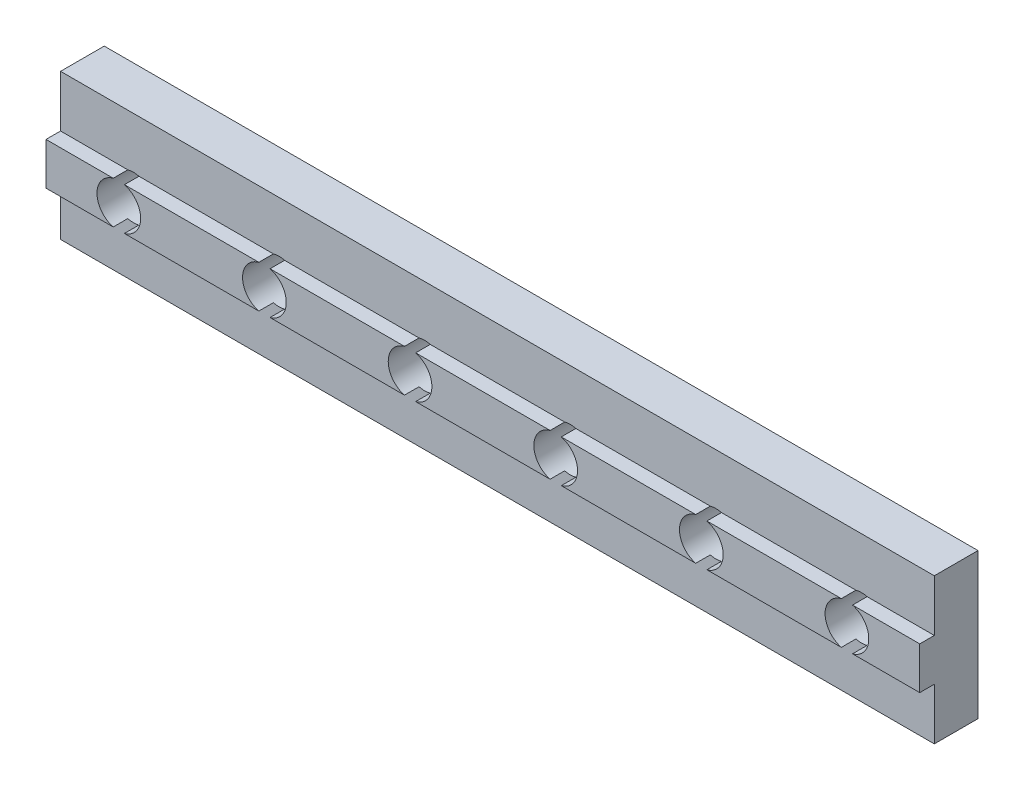
ISO-10303-21;
HEADER;
FILE_DESCRIPTION(('STEP AP214'),'2;1');
FILE_NAME('part.step','',(''),(''),'','','');
FILE_SCHEMA(('AUTOMOTIVE_DESIGN { 1 0 10303 214 1 1 1 1 }'));
ENDSEC;
DATA;
#1=APPLICATION_CONTEXT('core data for automotive mechanical design processes');
#2=APPLICATION_PROTOCOL_DEFINITION('international standard','automotive_design',2000,#1);
#3=PRODUCT_CONTEXT('',#1,'mechanical');
#4=PRODUCT('Part','Part','',(#3));
#5=PRODUCT_RELATED_PRODUCT_CATEGORY('part','',(#4));
#6=PRODUCT_DEFINITION_FORMATION('','',#4);
#7=PRODUCT_DEFINITION_CONTEXT('part definition',#1,'design');
#8=PRODUCT_DEFINITION('design','',#6,#7);
#9=PRODUCT_DEFINITION_SHAPE('','',#8);
#10=(LENGTH_UNIT() NAMED_UNIT(*) SI_UNIT(.MILLI.,.METRE.));
#11=(NAMED_UNIT(*) PLANE_ANGLE_UNIT() SI_UNIT($,.RADIAN.));
#12=(NAMED_UNIT(*) SI_UNIT($,.STERADIAN.) SOLID_ANGLE_UNIT());
#13=UNCERTAINTY_MEASURE_WITH_UNIT(LENGTH_MEASURE(1.E-05),#10,'distance_accuracy_value','');
#14=(GEOMETRIC_REPRESENTATION_CONTEXT(3) GLOBAL_UNCERTAINTY_ASSIGNED_CONTEXT((#13)) GLOBAL_UNIT_ASSIGNED_CONTEXT((#10,
#11,#12)) REPRESENTATION_CONTEXT('',''));
#15=CARTESIAN_POINT('',(0.,0.,0.));
#16=DIRECTION('',(0.,0.,1.));
#17=DIRECTION('',(1.,0.,0.));
#18=AXIS2_PLACEMENT_3D('',#15,#16,#17);
#19=CARTESIAN_POINT('',(60.,6.45000000000001,4.));
#20=DIRECTION('',(0.,-1.,0.));
#21=DIRECTION('',(1.,0.,0.));
#22=AXIS2_PLACEMENT_3D('',#19,#20,#21);
#23=PLANE('',#22);
#24=DIRECTION('',(-1.,0.,0.));
#25=VECTOR('',#24,1.);
#26=CARTESIAN_POINT('',(60.,6.45000000000001,4.));
#27=LINE('',#26,#25);
#28=CARTESIAN_POINT('',(34.6159427126066,6.45000000000001,4.));
#29=VERTEX_POINT('',#28);
#30=CARTESIAN_POINT('',(25.3840572873934,6.45000000000001,4.));
#31=VERTEX_POINT('',#30);
#32=EDGE_CURVE('E291',#29,#31,#27,.T.);
#33=ORIENTED_EDGE('',*,*,#32,.F.);
#34=DIRECTION('',(0.,0.,-1.));
#35=VECTOR('',#34,1.);
#36=CARTESIAN_POINT('',(34.6159427126066,6.45000000000001,4.));
#37=LINE('',#36,#35);
#38=CARTESIAN_POINT('',(34.6159427126066,6.45000000000001,3.));
#39=VERTEX_POINT('',#38);
#40=EDGE_CURVE('E346',#29,#39,#37,.T.);
#41=ORIENTED_EDGE('',*,*,#40,.T.);
#42=DIRECTION('',(-1.,0.,0.));
#43=VECTOR('',#42,1.);
#44=CARTESIAN_POINT('',(60.,6.45000000000001,3.));
#45=LINE('',#44,#43);
#46=CARTESIAN_POINT('',(25.3840572873934,6.45000000000001,3.));
#47=VERTEX_POINT('',#46);
#48=EDGE_CURVE('E406',#39,#47,#45,.T.);
#49=ORIENTED_EDGE('',*,*,#48,.T.);
#50=DIRECTION('',(0.,0.,-1.));
#51=VECTOR('',#50,1.);
#52=CARTESIAN_POINT('',(25.3840572873934,6.45000000000001,4.));
#53=LINE('',#52,#51);
#54=EDGE_CURVE('E333',#47,#31,#53,.F.);
#55=ORIENTED_EDGE('',*,*,#54,.T.);
#56=EDGE_LOOP('',(#33,#41,#49,#55));
#57=FACE_BOUND('',#56,.T.);
#58=ADVANCED_FACE('F33',(#57),#23,.F.);
#59=CARTESIAN_POINT('',(24.6159427126066,6.45000000000001,4.));
#60=VERTEX_POINT('',#59);
#61=CARTESIAN_POINT('',(15.3840572873934,6.45,4.));
#62=VERTEX_POINT('',#61);
#63=EDGE_CURVE('E273',#60,#62,#27,.T.);
#64=ORIENTED_EDGE('',*,*,#63,.F.);
#65=DIRECTION('',(0.,0.,-1.));
#66=VECTOR('',#65,1.);
#67=CARTESIAN_POINT('',(24.6159427126066,6.45000000000001,4.));
#68=LINE('',#67,#66);
#69=CARTESIAN_POINT('',(24.6159427126066,6.45000000000001,3.));
#70=VERTEX_POINT('',#69);
#71=EDGE_CURVE('E313',#60,#70,#68,.T.);
#72=ORIENTED_EDGE('',*,*,#71,.T.);
#73=CARTESIAN_POINT('',(15.3840572873934,6.45,3.));
#74=VERTEX_POINT('',#73);
#75=EDGE_CURVE('E316',#70,#74,#45,.T.);
#76=ORIENTED_EDGE('',*,*,#75,.T.);
#77=DIRECTION('',(0.,0.,-1.));
#78=VECTOR('',#77,1.);
#79=CARTESIAN_POINT('',(15.3840572873934,6.45,4.));
#80=LINE('',#79,#78);
#81=EDGE_CURVE('E315',#74,#62,#80,.F.);
#82=ORIENTED_EDGE('',*,*,#81,.T.);
#83=EDGE_LOOP('',(#64,#72,#76,#82));
#84=FACE_BOUND('',#83,.T.);
#85=ADVANCED_FACE('F311',(#84),#23,.F.);
#86=CARTESIAN_POINT('',(14.6159427126066,6.45,4.));
#87=VERTEX_POINT('',#86);
#88=CARTESIAN_POINT('',(5.38405728739344,6.45,4.));
#89=VERTEX_POINT('',#88);
#90=EDGE_CURVE('E268',#87,#89,#27,.T.);
#91=ORIENTED_EDGE('',*,*,#90,.F.);
#92=DIRECTION('',(0.,0.,-1.));
#93=VECTOR('',#92,1.);
#94=CARTESIAN_POINT('',(14.6159427126066,6.45,4.));
#95=LINE('',#94,#93);
#96=CARTESIAN_POINT('',(14.6159427126066,6.45,3.));
#97=VERTEX_POINT('',#96);
#98=EDGE_CURVE('E319',#87,#97,#95,.T.);
#99=ORIENTED_EDGE('',*,*,#98,.T.);
#100=CARTESIAN_POINT('',(5.38405728739344,6.45,3.));
#101=VERTEX_POINT('',#100);
#102=EDGE_CURVE('E391',#97,#101,#45,.T.);
#103=ORIENTED_EDGE('',*,*,#102,.T.);
#104=DIRECTION('',(0.,0.,-1.));
#105=VECTOR('',#104,1.);
#106=CARTESIAN_POINT('',(5.38405728739344,6.45,4.));
#107=LINE('',#106,#105);
#108=EDGE_CURVE('E252',#101,#89,#107,.F.);
#109=ORIENTED_EDGE('',*,*,#108,.T.);
#110=EDGE_LOOP('',(#91,#99,#103,#109));
#111=FACE_BOUND('',#110,.T.);
#112=ADVANCED_FACE('F575',(#111),#23,.F.);
#113=CARTESIAN_POINT('',(4.61594271260656,6.45,4.));
#114=VERTEX_POINT('',#113);
#115=CARTESIAN_POINT('',(0.,6.45,4.));
#116=VERTEX_POINT('',#115);
#117=EDGE_CURVE('E257',#114,#116,#27,.T.);
#118=ORIENTED_EDGE('',*,*,#117,.F.);
#119=DIRECTION('',(0.,0.,-1.));
#120=VECTOR('',#119,1.);
#121=CARTESIAN_POINT('',(4.61594271260655,6.45,4.));
#122=LINE('',#121,#120);
#123=CARTESIAN_POINT('',(4.61594271260656,6.45,3.));
#124=VERTEX_POINT('',#123);
#125=EDGE_CURVE('E241',#114,#124,#122,.T.);
#126=ORIENTED_EDGE('',*,*,#125,.T.);
#127=CARTESIAN_POINT('',(0.,6.45,3.));
#128=VERTEX_POINT('',#127);
#129=EDGE_CURVE('E387',#124,#128,#45,.T.);
#130=ORIENTED_EDGE('',*,*,#129,.T.);
#131=DIRECTION('',(0.,0.,-1.));
#132=VECTOR('',#131,1.);
#133=CARTESIAN_POINT('',(0.,6.45,4.));
#134=LINE('',#133,#132);
#135=EDGE_CURVE('E266',#116,#128,#134,.T.);
#136=ORIENTED_EDGE('',*,*,#135,.F.);
#137=EDGE_LOOP('',(#118,#126,#130,#136));
#138=FACE_BOUND('',#137,.T.);
#139=ADVANCED_FACE('F264',(#138),#23,.F.);
#140=CARTESIAN_POINT('',(0.,0.,4.));
#141=DIRECTION('',(0.,0.,1.));
#142=DIRECTION('',(1.,0.,0.));
#143=AXIS2_PLACEMENT_3D('',#140,#141,#142);
#144=PLANE('',#143);
#145=CARTESIAN_POINT('',(35.,5.,4.));
#146=DIRECTION('',(0.,0.,-1.));
#147=DIRECTION('',(-1.,0.,0.));
#148=AXIS2_PLACEMENT_3D('',#145,#146,#147);
#149=CIRCLE('',#148,1.5);
#150=CARTESIAN_POINT('',(34.6159427126065,3.55,4.));
#151=VERTEX_POINT('',#150);
#152=EDGE_CURVE('E48',#151,#29,#149,.T.);
#153=ORIENTED_EDGE('',*,*,#152,.T.);
#154=ORIENTED_EDGE('',*,*,#32,.T.);
#155=CARTESIAN_POINT('',(25.,5.,4.));
#156=DIRECTION('',(0.,0.,-1.));
#157=DIRECTION('',(-1.,0.,0.));
#158=AXIS2_PLACEMENT_3D('',#155,#156,#157);
#159=CIRCLE('',#158,1.5);
#160=CARTESIAN_POINT('',(25.3840572873935,3.55,4.));
#161=VERTEX_POINT('',#160);
#162=EDGE_CURVE('E415',#31,#161,#159,.T.);
#163=ORIENTED_EDGE('',*,*,#162,.T.);
#164=DIRECTION('',(1.,0.,0.));
#165=VECTOR('',#164,1.);
#166=CARTESIAN_POINT('',(60.,3.55000000000001,4.));
#167=LINE('',#166,#165);
#168=EDGE_CURVE('E483',#161,#151,#167,.T.);
#169=ORIENTED_EDGE('',*,*,#168,.T.);
#170=EDGE_LOOP('',(#153,#154,#163,#169));
#171=FACE_BOUND('',#170,.T.);
#172=ADVANCED_FACE('F606',(#171),#144,.T.);
#173=CARTESIAN_POINT('',(24.6159427126065,3.55,4.));
#174=VERTEX_POINT('',#173);
#175=EDGE_CURVE('E56',#174,#60,#159,.T.);
#176=ORIENTED_EDGE('',*,*,#175,.T.);
#177=ORIENTED_EDGE('',*,*,#63,.T.);
#178=CARTESIAN_POINT('',(15.,5.,4.));
#179=DIRECTION('',(0.,0.,-1.));
#180=DIRECTION('',(-1.,0.,0.));
#181=AXIS2_PLACEMENT_3D('',#178,#179,#180);
#182=CIRCLE('',#181,1.5);
#183=CARTESIAN_POINT('',(15.3840572873935,3.55,4.));
#184=VERTEX_POINT('',#183);
#185=EDGE_CURVE('E306',#62,#184,#182,.T.);
#186=ORIENTED_EDGE('',*,*,#185,.T.);
#187=EDGE_CURVE('E485',#184,#174,#167,.T.);
#188=ORIENTED_EDGE('',*,*,#187,.T.);
#189=EDGE_LOOP('',(#176,#177,#186,#188));
#190=FACE_BOUND('',#189,.T.);
#191=ADVANCED_FACE('F304',(#190),#144,.T.);
#192=CARTESIAN_POINT('',(14.6159427126066,3.55,4.));
#193=VERTEX_POINT('',#192);
#194=EDGE_CURVE('E429',#193,#87,#182,.T.);
#195=ORIENTED_EDGE('',*,*,#194,.T.);
#196=ORIENTED_EDGE('',*,*,#90,.T.);
#197=CARTESIAN_POINT('',(5.,5.,4.));
#198=DIRECTION('',(0.,0.,-1.));
#199=DIRECTION('',(-1.,0.,0.));
#200=AXIS2_PLACEMENT_3D('',#197,#198,#199);
#201=CIRCLE('',#200,1.5);
#202=CARTESIAN_POINT('',(5.38405728739345,3.55,4.));
#203=VERTEX_POINT('',#202);
#204=EDGE_CURVE('E261',#89,#203,#201,.T.);
#205=ORIENTED_EDGE('',*,*,#204,.T.);
#206=EDGE_CURVE('E486',#203,#193,#167,.T.);
#207=ORIENTED_EDGE('',*,*,#206,.T.);
#208=EDGE_LOOP('',(#195,#196,#205,#207));
#209=FACE_BOUND('',#208,.T.);
#210=ADVANCED_FACE('F618',(#209),#144,.T.);
#211=CARTESIAN_POINT('',(4.61594271260655,3.55,4.));
#212=VERTEX_POINT('',#211);
#213=EDGE_CURVE('E244',#212,#114,#201,.T.);
#214=ORIENTED_EDGE('',*,*,#213,.T.);
#215=ORIENTED_EDGE('',*,*,#117,.T.);
#216=DIRECTION('',(0.,-1.,0.));
#217=VECTOR('',#216,1.);
#218=CARTESIAN_POINT('',(0.,3.55,4.));
#219=LINE('',#218,#217);
#220=CARTESIAN_POINT('',(0.,3.55,4.));
#221=VERTEX_POINT('',#220);
#222=EDGE_CURVE('E279',#116,#221,#219,.T.);
#223=ORIENTED_EDGE('',*,*,#222,.T.);
#224=EDGE_CURVE('E260',#221,#212,#167,.T.);
#225=ORIENTED_EDGE('',*,*,#224,.T.);
#226=EDGE_LOOP('',(#214,#215,#223,#225));
#227=FACE_BOUND('',#226,.T.);
#228=ADVANCED_FACE('F256',(#227),#144,.T.);
#229=CARTESIAN_POINT('',(60.,3.55000000000001,4.));
#230=DIRECTION('',(0.,1.,0.));
#231=DIRECTION('',(-1.,0.,0.));
#232=AXIS2_PLACEMENT_3D('',#229,#230,#231);
#233=PLANE('',#232);
#234=CARTESIAN_POINT('',(35.3840572873935,3.55,4.));
#235=VERTEX_POINT('',#234);
#236=CARTESIAN_POINT('',(44.6159427126065,3.55000000000001,4.));
#237=VERTEX_POINT('',#236);
#238=EDGE_CURVE('E480',#235,#237,#167,.T.);
#239=ORIENTED_EDGE('',*,*,#238,.F.);
#240=DIRECTION('',(0.,0.,-1.));
#241=VECTOR('',#240,1.);
#242=CARTESIAN_POINT('',(35.3840572873935,3.55,4.));
#243=LINE('',#242,#241);
#244=CARTESIAN_POINT('',(35.3840572873935,3.55,3.));
#245=VERTEX_POINT('',#244);
#246=EDGE_CURVE('E11',#235,#245,#243,.T.);
#247=ORIENTED_EDGE('',*,*,#246,.T.);
#248=DIRECTION('',(1.,0.,0.));
#249=VECTOR('',#248,1.);
#250=CARTESIAN_POINT('',(60.,3.55000000000001,3.));
#251=LINE('',#250,#249);
#252=CARTESIAN_POINT('',(44.6159427126065,3.55000000000001,3.));
#253=VERTEX_POINT('',#252);
#254=EDGE_CURVE('E463',#245,#253,#251,.T.);
#255=ORIENTED_EDGE('',*,*,#254,.T.);
#256=DIRECTION('',(0.,0.,-1.));
#257=VECTOR('',#256,1.);
#258=CARTESIAN_POINT('',(44.6159427126065,3.55000000000001,4.));
#259=LINE('',#258,#257);
#260=EDGE_CURVE('E481',#253,#237,#259,.F.);
#261=ORIENTED_EDGE('',*,*,#260,.T.);
#262=EDGE_LOOP('',(#239,#247,#255,#261));
#263=FACE_BOUND('',#262,.T.);
#264=ADVANCED_FACE('F479',(#263),#233,.F.);
#265=CARTESIAN_POINT('',(25.3840572873935,3.55,3.));
#266=VERTEX_POINT('',#265);
#267=CARTESIAN_POINT('',(34.6159427126065,3.55,3.));
#268=VERTEX_POINT('',#267);
#269=EDGE_CURVE('E464',#266,#268,#251,.T.);
#270=ORIENTED_EDGE('',*,*,#269,.T.);
#271=DIRECTION('',(0.,0.,-1.));
#272=VECTOR('',#271,1.);
#273=CARTESIAN_POINT('',(34.6159427126065,3.55,4.));
#274=LINE('',#273,#272);
#275=EDGE_CURVE('E41',#268,#151,#274,.F.);
#276=ORIENTED_EDGE('',*,*,#275,.T.);
#277=ORIENTED_EDGE('',*,*,#168,.F.);
#278=DIRECTION('',(0.,0.,-1.));
#279=VECTOR('',#278,1.);
#280=CARTESIAN_POINT('',(25.3840572873935,3.55,4.));
#281=LINE('',#280,#279);
#282=EDGE_CURVE('E417',#161,#266,#281,.T.);
#283=ORIENTED_EDGE('',*,*,#282,.T.);
#284=EDGE_LOOP('',(#270,#276,#277,#283));
#285=FACE_BOUND('',#284,.T.);
#286=ADVANCED_FACE('F476',(#285),#233,.F.);
#287=CARTESIAN_POINT('',(15.3840572873935,3.55,3.));
#288=VERTEX_POINT('',#287);
#289=CARTESIAN_POINT('',(24.6159427126065,3.55,3.));
#290=VERTEX_POINT('',#289);
#291=EDGE_CURVE('E452',#288,#290,#251,.T.);
#292=ORIENTED_EDGE('',*,*,#291,.T.);
#293=DIRECTION('',(0.,0.,-1.));
#294=VECTOR('',#293,1.);
#295=CARTESIAN_POINT('',(24.6159427126065,3.55,4.));
#296=LINE('',#295,#294);
#297=EDGE_CURVE('E552',#290,#174,#296,.F.);
#298=ORIENTED_EDGE('',*,*,#297,.T.);
#299=ORIENTED_EDGE('',*,*,#187,.F.);
#300=DIRECTION('',(0.,0.,-1.));
#301=VECTOR('',#300,1.);
#302=CARTESIAN_POINT('',(15.3840572873935,3.55,4.));
#303=LINE('',#302,#301);
#304=EDGE_CURVE('E550',#184,#288,#303,.T.);
#305=ORIENTED_EDGE('',*,*,#304,.T.);
#306=EDGE_LOOP('',(#292,#298,#299,#305));
#307=FACE_BOUND('',#306,.T.);
#308=ADVANCED_FACE('F555',(#307),#233,.F.);
#309=CARTESIAN_POINT('',(5.38405728739345,3.55,3.));
#310=VERTEX_POINT('',#309);
#311=CARTESIAN_POINT('',(14.6159427126065,3.55,3.));
#312=VERTEX_POINT('',#311);
#313=EDGE_CURVE('E450',#310,#312,#251,.T.);
#314=ORIENTED_EDGE('',*,*,#313,.T.);
#315=DIRECTION('',(0.,0.,-1.));
#316=VECTOR('',#315,1.);
#317=CARTESIAN_POINT('',(14.6159427126065,3.55,4.));
#318=LINE('',#317,#316);
#319=EDGE_CURVE('E459',#312,#193,#318,.F.);
#320=ORIENTED_EDGE('',*,*,#319,.T.);
#321=ORIENTED_EDGE('',*,*,#206,.F.);
#322=DIRECTION('',(0.,0.,-1.));
#323=VECTOR('',#322,1.);
#324=CARTESIAN_POINT('',(5.38405728739345,3.55,4.));
#325=LINE('',#324,#323);
#326=EDGE_CURVE('E461',#203,#310,#325,.T.);
#327=ORIENTED_EDGE('',*,*,#326,.T.);
#328=EDGE_LOOP('',(#314,#320,#321,#327));
#329=FACE_BOUND('',#328,.T.);
#330=ADVANCED_FACE('F457',(#329),#233,.F.);
#331=CARTESIAN_POINT('',(44.6159427126066,6.45000000000001,3.));
#332=VERTEX_POINT('',#331);
#333=CARTESIAN_POINT('',(35.3840572873934,6.45000000000001,3.));
#334=VERTEX_POINT('',#333);
#335=EDGE_CURVE('E404',#332,#334,#45,.T.);
#336=ORIENTED_EDGE('',*,*,#335,.T.);
#337=DIRECTION('',(0.,0.,-1.));
#338=VECTOR('',#337,1.);
#339=CARTESIAN_POINT('',(35.3840572873934,6.45000000000001,4.));
#340=LINE('',#339,#338);
#341=CARTESIAN_POINT('',(35.3840572873934,6.45000000000001,4.));
#342=VERTEX_POINT('',#341);
#343=EDGE_CURVE('E343',#334,#342,#340,.F.);
#344=ORIENTED_EDGE('',*,*,#343,.T.);
#345=CARTESIAN_POINT('',(44.6159427126066,6.45000000000001,4.));
#346=VERTEX_POINT('',#345);
#347=EDGE_CURVE('E285',#346,#342,#27,.T.);
#348=ORIENTED_EDGE('',*,*,#347,.F.);
#349=DIRECTION('',(0.,0.,-1.));
#350=VECTOR('',#349,1.);
#351=CARTESIAN_POINT('',(44.6159427126066,6.45000000000001,4.));
#352=LINE('',#351,#350);
#353=EDGE_CURVE('E364',#346,#332,#352,.T.);
#354=ORIENTED_EDGE('',*,*,#353,.T.);
#355=EDGE_LOOP('',(#336,#344,#348,#354));
#356=FACE_BOUND('',#355,.T.);
#357=ADVANCED_FACE('F592',(#356),#23,.F.);
#358=EDGE_CURVE('E440',#342,#235,#149,.T.);
#359=ORIENTED_EDGE('',*,*,#358,.T.);
#360=ORIENTED_EDGE('',*,*,#238,.T.);
#361=CARTESIAN_POINT('',(45.,5.,4.));
#362=DIRECTION('',(0.,0.,-1.));
#363=DIRECTION('',(-1.,0.,0.));
#364=AXIS2_PLACEMENT_3D('',#361,#362,#363);
#365=CIRCLE('',#364,1.5);
#366=EDGE_CURVE('E350',#237,#346,#365,.T.);
#367=ORIENTED_EDGE('',*,*,#366,.T.);
#368=ORIENTED_EDGE('',*,*,#347,.T.);
#369=EDGE_LOOP('',(#359,#360,#367,#368));
#370=FACE_BOUND('',#369,.T.);
#371=ADVANCED_FACE('F598',(#370),#144,.T.);
#372=CARTESIAN_POINT('',(45.3840572873935,3.55000000000001,4.));
#373=VERTEX_POINT('',#372);
#374=CARTESIAN_POINT('',(54.6159427126065,3.55000000000001,4.));
#375=VERTEX_POINT('',#374);
#376=EDGE_CURVE('E484',#373,#375,#167,.T.);
#377=ORIENTED_EDGE('',*,*,#376,.F.);
#378=DIRECTION('',(0.,0.,-1.));
#379=VECTOR('',#378,1.);
#380=CARTESIAN_POINT('',(45.3840572873935,3.55000000000001,4.));
#381=LINE('',#380,#379);
#382=CARTESIAN_POINT('',(45.3840572873935,3.55000000000001,3.));
#383=VERTEX_POINT('',#382);
#384=EDGE_CURVE('E544',#373,#383,#381,.T.);
#385=ORIENTED_EDGE('',*,*,#384,.T.);
#386=CARTESIAN_POINT('',(54.6159427126065,3.55000000000001,3.));
#387=VERTEX_POINT('',#386);
#388=EDGE_CURVE('E403',#383,#387,#251,.T.);
#389=ORIENTED_EDGE('',*,*,#388,.T.);
#390=DIRECTION('',(0.,0.,-1.));
#391=VECTOR('',#390,1.);
#392=CARTESIAN_POINT('',(54.6159427126065,3.55000000000001,4.));
#393=LINE('',#392,#391);
#394=EDGE_CURVE('E370',#387,#375,#393,.F.);
#395=ORIENTED_EDGE('',*,*,#394,.T.);
#396=EDGE_LOOP('',(#377,#385,#389,#395));
#397=FACE_BOUND('',#396,.T.);
#398=ADVANCED_FACE('F591',(#397),#233,.F.);
#399=CARTESIAN_POINT('',(54.6159427126066,6.45000000000001,3.));
#400=VERTEX_POINT('',#399);
#401=CARTESIAN_POINT('',(45.3840572873934,6.45000000000001,3.));
#402=VERTEX_POINT('',#401);
#403=EDGE_CURVE('E400',#400,#402,#45,.T.);
#404=ORIENTED_EDGE('',*,*,#403,.T.);
#405=DIRECTION('',(0.,0.,-1.));
#406=VECTOR('',#405,1.);
#407=CARTESIAN_POINT('',(45.3840572873934,6.45000000000001,4.));
#408=LINE('',#407,#406);
#409=CARTESIAN_POINT('',(45.3840572873934,6.45000000000001,4.));
#410=VERTEX_POINT('',#409);
#411=EDGE_CURVE('E361',#402,#410,#408,.F.);
#412=ORIENTED_EDGE('',*,*,#411,.T.);
#413=CARTESIAN_POINT('',(54.6159427126066,6.45000000000001,4.));
#414=VERTEX_POINT('',#413);
#415=EDGE_CURVE('E280',#414,#410,#27,.T.);
#416=ORIENTED_EDGE('',*,*,#415,.F.);
#417=DIRECTION('',(0.,0.,-1.));
#418=VECTOR('',#417,1.);
#419=CARTESIAN_POINT('',(54.6159427126066,6.45000000000001,4.));
#420=LINE('',#419,#418);
#421=EDGE_CURVE('E385',#414,#400,#420,.T.);
#422=ORIENTED_EDGE('',*,*,#421,.T.);
#423=EDGE_LOOP('',(#404,#412,#416,#422));
#424=FACE_BOUND('',#423,.T.);
#425=ADVANCED_FACE('F581',(#424),#23,.F.);
#426=CARTESIAN_POINT('',(55.3840572873935,3.55000000000001,4.));
#427=VERTEX_POINT('',#426);
#428=CARTESIAN_POINT('',(60.,3.55000000000001,4.));
#429=VERTEX_POINT('',#428);
#430=EDGE_CURVE('E283',#427,#429,#167,.T.);
#431=ORIENTED_EDGE('',*,*,#430,.F.);
#432=DIRECTION('',(0.,0.,-1.));
#433=VECTOR('',#432,1.);
#434=CARTESIAN_POINT('',(55.3840572873935,3.55000000000001,4.));
#435=LINE('',#434,#433);
#436=CARTESIAN_POINT('',(55.3840572873935,3.55000000000001,3.));
#437=VERTEX_POINT('',#436);
#438=EDGE_CURVE('E376',#427,#437,#435,.T.);
#439=ORIENTED_EDGE('',*,*,#438,.T.);
#440=CARTESIAN_POINT('',(60.,3.55,3.));
#441=VERTEX_POINT('',#440);
#442=EDGE_CURVE('E399',#437,#441,#251,.T.);
#443=ORIENTED_EDGE('',*,*,#442,.T.);
#444=DIRECTION('',(0.,0.,-1.));
#445=VECTOR('',#444,1.);
#446=CARTESIAN_POINT('',(60.,3.55000000000001,4.));
#447=LINE('',#446,#445);
#448=EDGE_CURVE('E487',#429,#441,#447,.T.);
#449=ORIENTED_EDGE('',*,*,#448,.F.);
#450=EDGE_LOOP('',(#431,#439,#443,#449));
#451=FACE_BOUND('',#450,.T.);
#452=ADVANCED_FACE('F497',(#451),#233,.F.);
#453=EDGE_CURVE('E352',#410,#373,#365,.T.);
#454=ORIENTED_EDGE('',*,*,#453,.T.);
#455=ORIENTED_EDGE('',*,*,#376,.T.);
#456=CARTESIAN_POINT('',(55.,5.,4.));
#457=DIRECTION('',(0.,0.,1.));
#458=DIRECTION('',(1.,0.,0.));
#459=AXIS2_PLACEMENT_3D('',#456,#457,#458);
#460=CIRCLE('',#459,1.5);
#461=EDGE_CURVE('E542',#414,#375,#460,.T.);
#462=ORIENTED_EDGE('',*,*,#461,.F.);
#463=ORIENTED_EDGE('',*,*,#415,.T.);
#464=EDGE_LOOP('',(#454,#455,#462,#463));
#465=FACE_BOUND('',#464,.T.);
#466=ADVANCED_FACE('F597',(#465),#144,.T.);
#467=CARTESIAN_POINT('',(0.,0.,3.));
#468=DIRECTION('',(0.,0.,-1.));
#469=DIRECTION('',(-1.,0.,0.));
#470=AXIS2_PLACEMENT_3D('',#467,#468,#469);
#471=PLANE('',#470);
#472=ORIENTED_EDGE('',*,*,#254,.F.);
#473=CARTESIAN_POINT('',(35.,5.,3.));
#474=DIRECTION('',(0.,0.,-1.));
#475=DIRECTION('',(-1.,0.,0.));
#476=AXIS2_PLACEMENT_3D('',#473,#474,#475);
#477=CIRCLE('',#476,1.5);
#478=EDGE_CURVE('E337',#245,#268,#477,.T.);
#479=ORIENTED_EDGE('',*,*,#478,.T.);
#480=ORIENTED_EDGE('',*,*,#269,.F.);
#481=CARTESIAN_POINT('',(25.,5.,3.));
#482=DIRECTION('',(0.,0.,-1.));
#483=DIRECTION('',(-1.,0.,0.));
#484=AXIS2_PLACEMENT_3D('',#481,#482,#483);
#485=CIRCLE('',#484,1.5);
#486=EDGE_CURVE('E323',#266,#290,#485,.T.);
#487=ORIENTED_EDGE('',*,*,#486,.T.);
#488=ORIENTED_EDGE('',*,*,#291,.F.);
#489=CARTESIAN_POINT('',(15.,5.,3.));
#490=DIRECTION('',(0.,0.,-1.));
#491=DIRECTION('',(-1.,0.,0.));
#492=AXIS2_PLACEMENT_3D('',#489,#490,#491);
#493=CIRCLE('',#492,1.5);
#494=EDGE_CURVE('E251',#288,#312,#493,.T.);
#495=ORIENTED_EDGE('',*,*,#494,.T.);
#496=ORIENTED_EDGE('',*,*,#313,.F.);
#497=CARTESIAN_POINT('',(5.,5.,3.));
#498=DIRECTION('',(0.,0.,-1.));
#499=DIRECTION('',(-1.,0.,0.));
#500=AXIS2_PLACEMENT_3D('',#497,#498,#499);
#501=CIRCLE('',#500,1.5);
#502=CARTESIAN_POINT('',(4.61594271260655,3.55,3.));
#503=VERTEX_POINT('',#502);
#504=EDGE_CURVE('E437',#310,#503,#501,.T.);
#505=ORIENTED_EDGE('',*,*,#504,.T.);
#506=CARTESIAN_POINT('',(0.,3.55,3.));
#507=VERTEX_POINT('',#506);
#508=EDGE_CURVE('E275',#507,#503,#251,.T.);
#509=ORIENTED_EDGE('',*,*,#508,.F.);
#510=DIRECTION('',(0.,-1.,0.));
#511=VECTOR('',#510,1.);
#512=CARTESIAN_POINT('',(0.,0.,3.));
#513=LINE('',#512,#511);
#514=CARTESIAN_POINT('',(0.,0.,3.));
#515=VERTEX_POINT('',#514);
#516=EDGE_CURVE('E518',#507,#515,#513,.T.);
#517=ORIENTED_EDGE('',*,*,#516,.T.);
#518=DIRECTION('',(1.,0.,0.));
#519=VECTOR('',#518,1.);
#520=CARTESIAN_POINT('',(0.,0.,3.));
#521=LINE('',#520,#519);
#522=CARTESIAN_POINT('',(60.,0.,3.));
#523=VERTEX_POINT('',#522);
#524=EDGE_CURVE('E517',#515,#523,#521,.T.);
#525=ORIENTED_EDGE('',*,*,#524,.T.);
#526=DIRECTION('',(0.,1.,0.));
#527=VECTOR('',#526,1.);
#528=CARTESIAN_POINT('',(60.,0.,3.));
#529=LINE('',#528,#527);
#530=EDGE_CURVE('E520',#523,#441,#529,.T.);
#531=ORIENTED_EDGE('',*,*,#530,.T.);
#532=ORIENTED_EDGE('',*,*,#442,.F.);
#533=CARTESIAN_POINT('',(55.,5.,3.));
#534=DIRECTION('',(0.,0.,-1.));
#535=DIRECTION('',(-1.,0.,0.));
#536=AXIS2_PLACEMENT_3D('',#533,#534,#535);
#537=CIRCLE('',#536,1.5);
#538=EDGE_CURVE('E373',#437,#387,#537,.T.);
#539=ORIENTED_EDGE('',*,*,#538,.T.);
#540=ORIENTED_EDGE('',*,*,#388,.F.);
#541=CARTESIAN_POINT('',(45.,5.,3.));
#542=DIRECTION('',(0.,0.,-1.));
#543=DIRECTION('',(-1.,0.,0.));
#544=AXIS2_PLACEMENT_3D('',#541,#542,#543);
#545=CIRCLE('',#544,1.5);
#546=EDGE_CURVE('E355',#383,#253,#545,.T.);
#547=ORIENTED_EDGE('',*,*,#546,.T.);
#548=EDGE_LOOP('',(#472,#479,#480,#487,#488,#495,#496,#505,#509,#517,#525,#531,#532,#539,#540,#547));
#549=FACE_BOUND('',#548,.T.);
#550=ADVANCED_FACE('F449',(#549),#471,.F.);
#551=ORIENTED_EDGE('',*,*,#48,.F.);
#552=CARTESIAN_POINT('',(35.,5.,3.));
#553=DIRECTION('',(0.,0.,-1.));
#554=DIRECTION('',(-1.,0.,0.));
#555=AXIS2_PLACEMENT_3D('',#552,#553,#554);
#556=CIRCLE('',#555,1.5);
#557=EDGE_CURVE('E340',#39,#334,#556,.T.);
#558=ORIENTED_EDGE('',*,*,#557,.T.);
#559=ORIENTED_EDGE('',*,*,#335,.F.);
#560=CARTESIAN_POINT('',(45.,5.,3.));
#561=DIRECTION('',(0.,0.,-1.));
#562=DIRECTION('',(-1.,0.,0.));
#563=AXIS2_PLACEMENT_3D('',#560,#561,#562);
#564=CIRCLE('',#563,1.5);
#565=EDGE_CURVE('E358',#332,#402,#564,.T.);
#566=ORIENTED_EDGE('',*,*,#565,.T.);
#567=ORIENTED_EDGE('',*,*,#403,.F.);
#568=CARTESIAN_POINT('',(55.,5.,3.));
#569=DIRECTION('',(0.,0.,-1.));
#570=DIRECTION('',(-1.,0.,0.));
#571=AXIS2_PLACEMENT_3D('',#568,#569,#570);
#572=CIRCLE('',#571,1.5);
#573=CARTESIAN_POINT('',(55.3840572873934,6.45000000000001,3.));
#574=VERTEX_POINT('',#573);
#575=EDGE_CURVE('E382',#400,#574,#572,.T.);
#576=ORIENTED_EDGE('',*,*,#575,.T.);
#577=CARTESIAN_POINT('',(60.,6.45000000000001,3.));
#578=VERTEX_POINT('',#577);
#579=EDGE_CURVE('E393',#578,#574,#45,.T.);
#580=ORIENTED_EDGE('',*,*,#579,.F.);
#581=CARTESIAN_POINT('',(60.,10.,3.));
#582=VERTEX_POINT('',#581);
#583=EDGE_CURVE('E506',#578,#582,#529,.T.);
#584=ORIENTED_EDGE('',*,*,#583,.T.);
#585=DIRECTION('',(-1.,0.,0.));
#586=VECTOR('',#585,1.);
#587=CARTESIAN_POINT('',(0.,10.,3.));
#588=LINE('',#587,#586);
#589=CARTESIAN_POINT('',(0.,10.,3.));
#590=VERTEX_POINT('',#589);
#591=EDGE_CURVE('E522',#582,#590,#588,.T.);
#592=ORIENTED_EDGE('',*,*,#591,.T.);
#593=EDGE_CURVE('E515',#590,#128,#513,.T.);
#594=ORIENTED_EDGE('',*,*,#593,.T.);
#595=ORIENTED_EDGE('',*,*,#129,.F.);
#596=CARTESIAN_POINT('',(5.,5.,3.));
#597=DIRECTION('',(0.,0.,-1.));
#598=DIRECTION('',(-1.,0.,0.));
#599=AXIS2_PLACEMENT_3D('',#596,#597,#598);
#600=CIRCLE('',#599,1.5);
#601=EDGE_CURVE('E247',#124,#101,#600,.T.);
#602=ORIENTED_EDGE('',*,*,#601,.T.);
#603=ORIENTED_EDGE('',*,*,#102,.F.);
#604=CARTESIAN_POINT('',(15.,5.,3.));
#605=DIRECTION('',(0.,0.,-1.));
#606=DIRECTION('',(-1.,0.,0.));
#607=AXIS2_PLACEMENT_3D('',#604,#605,#606);
#608=CIRCLE('',#607,1.5);
#609=EDGE_CURVE('E320',#97,#74,#608,.T.);
#610=ORIENTED_EDGE('',*,*,#609,.T.);
#611=ORIENTED_EDGE('',*,*,#75,.F.);
#612=CARTESIAN_POINT('',(25.,5.,3.));
#613=DIRECTION('',(0.,0.,-1.));
#614=DIRECTION('',(-1.,0.,0.));
#615=AXIS2_PLACEMENT_3D('',#612,#613,#614);
#616=CIRCLE('',#615,1.5);
#617=EDGE_CURVE('E330',#70,#47,#616,.T.);
#618=ORIENTED_EDGE('',*,*,#617,.T.);
#619=EDGE_LOOP('',(#551,#558,#559,#566,#567,#576,#580,#584,#592,#594,#595,#602,#603,#610,#611,#618));
#620=FACE_BOUND('',#619,.T.);
#621=ADVANCED_FACE('F413',(#620),#471,.F.);
#622=CARTESIAN_POINT('',(0.,0.,3.));
#623=DIRECTION('',(1.,0.,0.));
#624=DIRECTION('',(0.,0.,-1.));
#625=AXIS2_PLACEMENT_3D('',#622,#623,#624);
#626=PLANE('',#625);
#627=DIRECTION('',(0.,-1.,0.));
#628=VECTOR('',#627,1.);
#629=CARTESIAN_POINT('',(0.,0.,0.));
#630=LINE('',#629,#628);
#631=CARTESIAN_POINT('',(0.,10.,0.));
#632=VERTEX_POINT('',#631);
#633=CARTESIAN_POINT('',(0.,0.,0.));
#634=VERTEX_POINT('',#633);
#635=EDGE_CURVE('E507',#632,#634,#630,.T.);
#636=ORIENTED_EDGE('',*,*,#635,.T.);
#637=DIRECTION('',(0.,0.,-1.));
#638=VECTOR('',#637,1.);
#639=CARTESIAN_POINT('',(0.,0.,3.));
#640=LINE('',#639,#638);
#641=EDGE_CURVE('E538',#515,#634,#640,.T.);
#642=ORIENTED_EDGE('',*,*,#641,.F.);
#643=ORIENTED_EDGE('',*,*,#516,.F.);
#644=DIRECTION('',(0.,0.,-1.));
#645=VECTOR('',#644,1.);
#646=CARTESIAN_POINT('',(0.,3.55,4.));
#647=LINE('',#646,#645);
#648=EDGE_CURVE('E489',#221,#507,#647,.T.);
#649=ORIENTED_EDGE('',*,*,#648,.F.);
#650=ORIENTED_EDGE('',*,*,#222,.F.);
#651=ORIENTED_EDGE('',*,*,#135,.T.);
#652=ORIENTED_EDGE('',*,*,#593,.F.);
#653=DIRECTION('',(0.,0.,-1.));
#654=VECTOR('',#653,1.);
#655=CARTESIAN_POINT('',(0.,10.,3.));
#656=LINE('',#655,#654);
#657=EDGE_CURVE('E523',#590,#632,#656,.T.);
#658=ORIENTED_EDGE('',*,*,#657,.T.);
#659=EDGE_LOOP('',(#636,#642,#643,#649,#650,#651,#652,#658));
#660=FACE_BOUND('',#659,.T.);
#661=ADVANCED_FACE('F35',(#660),#626,.F.);
#662=CARTESIAN_POINT('',(0.,0.,3.));
#663=DIRECTION('',(0.,1.,0.));
#664=DIRECTION('',(0.,0.,1.));
#665=AXIS2_PLACEMENT_3D('',#662,#663,#664);
#666=PLANE('',#665);
#667=DIRECTION('',(1.,0.,0.));
#668=VECTOR('',#667,1.);
#669=CARTESIAN_POINT('',(0.,0.,0.));
#670=LINE('',#669,#668);
#671=CARTESIAN_POINT('',(60.,0.,0.));
#672=VERTEX_POINT('',#671);
#673=EDGE_CURVE('E510',#634,#672,#670,.T.);
#674=ORIENTED_EDGE('',*,*,#673,.T.);
#675=DIRECTION('',(0.,0.,-1.));
#676=VECTOR('',#675,1.);
#677=CARTESIAN_POINT('',(60.,0.,3.));
#678=LINE('',#677,#676);
#679=EDGE_CURVE('E535',#523,#672,#678,.T.);
#680=ORIENTED_EDGE('',*,*,#679,.F.);
#681=ORIENTED_EDGE('',*,*,#524,.F.);
#682=ORIENTED_EDGE('',*,*,#641,.T.);
#683=EDGE_LOOP('',(#674,#680,#681,#682));
#684=FACE_BOUND('',#683,.T.);
#685=ADVANCED_FACE('F627',(#684),#666,.F.);
#686=CARTESIAN_POINT('',(60.,0.,3.));
#687=DIRECTION('',(-1.,0.,0.));
#688=DIRECTION('',(0.,0.,1.));
#689=AXIS2_PLACEMENT_3D('',#686,#687,#688);
#690=PLANE('',#689);
#691=DIRECTION('',(0.,1.,0.));
#692=VECTOR('',#691,1.);
#693=CARTESIAN_POINT('',(60.,0.,0.));
#694=LINE('',#693,#692);
#695=CARTESIAN_POINT('',(60.,10.,0.));
#696=VERTEX_POINT('',#695);
#697=EDGE_CURVE('E526',#672,#696,#694,.T.);
#698=ORIENTED_EDGE('',*,*,#697,.T.);
#699=DIRECTION('',(0.,0.,-1.));
#700=VECTOR('',#699,1.);
#701=CARTESIAN_POINT('',(60.,10.,3.));
#702=LINE('',#701,#700);
#703=EDGE_CURVE('E532',#582,#696,#702,.T.);
#704=ORIENTED_EDGE('',*,*,#703,.F.);
#705=ORIENTED_EDGE('',*,*,#583,.F.);
#706=DIRECTION('',(0.,0.,-1.));
#707=VECTOR('',#706,1.);
#708=CARTESIAN_POINT('',(60.,6.45000000000001,4.));
#709=LINE('',#708,#707);
#710=CARTESIAN_POINT('',(60.,6.45000000000001,4.));
#711=VERTEX_POINT('',#710);
#712=EDGE_CURVE('E504',#711,#578,#709,.T.);
#713=ORIENTED_EDGE('',*,*,#712,.F.);
#714=DIRECTION('',(0.,1.,0.));
#715=VECTOR('',#714,1.);
#716=CARTESIAN_POINT('',(60.,3.55000000000001,4.));
#717=LINE('',#716,#715);
#718=EDGE_CURVE('E269',#429,#711,#717,.T.);
#719=ORIENTED_EDGE('',*,*,#718,.F.);
#720=ORIENTED_EDGE('',*,*,#448,.T.);
#721=ORIENTED_EDGE('',*,*,#530,.F.);
#722=ORIENTED_EDGE('',*,*,#679,.T.);
#723=EDGE_LOOP('',(#698,#704,#705,#713,#719,#720,#721,#722));
#724=FACE_BOUND('',#723,.T.);
#725=ADVANCED_FACE('F502',(#724),#690,.F.);
#726=CARTESIAN_POINT('',(0.,10.,3.));
#727=DIRECTION('',(0.,-1.,0.));
#728=DIRECTION('',(0.,0.,-1.));
#729=AXIS2_PLACEMENT_3D('',#726,#727,#728);
#730=PLANE('',#729);
#731=DIRECTION('',(-1.,0.,0.));
#732=VECTOR('',#731,1.);
#733=CARTESIAN_POINT('',(0.,10.,0.));
#734=LINE('',#733,#732);
#735=EDGE_CURVE('E528',#696,#632,#734,.T.);
#736=ORIENTED_EDGE('',*,*,#735,.T.);
#737=ORIENTED_EDGE('',*,*,#657,.F.);
#738=ORIENTED_EDGE('',*,*,#591,.F.);
#739=ORIENTED_EDGE('',*,*,#703,.T.);
#740=EDGE_LOOP('',(#736,#737,#738,#739));
#741=FACE_BOUND('',#740,.T.);
#742=ADVANCED_FACE('F587',(#741),#730,.F.);
#743=CARTESIAN_POINT('',(0.,0.,0.));
#744=DIRECTION('',(0.,0.,-1.));
#745=DIRECTION('',(-1.,0.,0.));
#746=AXIS2_PLACEMENT_3D('',#743,#744,#745);
#747=PLANE('',#746);
#748=CARTESIAN_POINT('',(35.,5.,0.));
#749=DIRECTION('',(0.,0.,-1.));
#750=DIRECTION('',(-1.,0.,0.));
#751=AXIS2_PLACEMENT_3D('',#748,#749,#750);
#752=CIRCLE('',#751,1.5);
#753=CARTESIAN_POINT('',(33.5,5.,0.));
#754=VERTEX_POINT('',#753);
#755=EDGE_CURVE('E420',#754,#754,#752,.T.);
#756=ORIENTED_EDGE('',*,*,#755,.F.);
#757=EDGE_LOOP('',(#756));
#758=FACE_BOUND('',#757,.T.);
#759=CARTESIAN_POINT('',(25.,5.,0.));
#760=DIRECTION('',(0.,0.,-1.));
#761=DIRECTION('',(-1.,0.,0.));
#762=AXIS2_PLACEMENT_3D('',#759,#760,#761);
#763=CIRCLE('',#762,1.5);
#764=CARTESIAN_POINT('',(23.5,5.,0.));
#765=VERTEX_POINT('',#764);
#766=EDGE_CURVE('E424',#765,#765,#763,.T.);
#767=ORIENTED_EDGE('',*,*,#766,.F.);
#768=EDGE_LOOP('',(#767));
#769=FACE_BOUND('',#768,.T.);
#770=CARTESIAN_POINT('',(15.,5.,0.));
#771=DIRECTION('',(0.,0.,-1.));
#772=DIRECTION('',(-1.,0.,0.));
#773=AXIS2_PLACEMENT_3D('',#770,#771,#772);
#774=CIRCLE('',#773,1.5);
#775=CARTESIAN_POINT('',(13.5,5.,0.));
#776=VERTEX_POINT('',#775);
#777=EDGE_CURVE('E432',#776,#776,#774,.T.);
#778=ORIENTED_EDGE('',*,*,#777,.F.);
#779=EDGE_LOOP('',(#778));
#780=FACE_BOUND('',#779,.T.);
#781=CARTESIAN_POINT('',(5.,5.,0.));
#782=DIRECTION('',(0.,0.,-1.));
#783=DIRECTION('',(-1.,0.,0.));
#784=AXIS2_PLACEMENT_3D('',#781,#782,#783);
#785=CIRCLE('',#784,1.5);
#786=CARTESIAN_POINT('',(3.49999999999999,5.,0.));
#787=VERTEX_POINT('',#786);
#788=EDGE_CURVE('E262',#787,#787,#785,.T.);
#789=ORIENTED_EDGE('',*,*,#788,.F.);
#790=EDGE_LOOP('',(#789));
#791=FACE_BOUND('',#790,.T.);
#792=CARTESIAN_POINT('',(45.,5.,0.));
#793=DIRECTION('',(0.,0.,-1.));
#794=DIRECTION('',(-1.,0.,0.));
#795=AXIS2_PLACEMENT_3D('',#792,#793,#794);
#796=CIRCLE('',#795,1.5);
#797=CARTESIAN_POINT('',(43.5,5.,0.));
#798=VERTEX_POINT('',#797);
#799=EDGE_CURVE('E349',#798,#798,#796,.T.);
#800=ORIENTED_EDGE('',*,*,#799,.F.);
#801=EDGE_LOOP('',(#800));
#802=FACE_BOUND('',#801,.T.);
#803=CARTESIAN_POINT('',(55.,5.,0.));
#804=DIRECTION('',(0.,0.,-1.));
#805=DIRECTION('',(-1.,0.,0.));
#806=AXIS2_PLACEMENT_3D('',#803,#804,#805);
#807=CIRCLE('',#806,1.5);
#808=CARTESIAN_POINT('',(53.5,5.,0.));
#809=VERTEX_POINT('',#808);
#810=EDGE_CURVE('E367',#809,#809,#807,.T.);
#811=ORIENTED_EDGE('',*,*,#810,.F.);
#812=EDGE_LOOP('',(#811));
#813=FACE_BOUND('',#812,.T.);
#814=ORIENTED_EDGE('',*,*,#635,.F.);
#815=ORIENTED_EDGE('',*,*,#735,.F.);
#816=ORIENTED_EDGE('',*,*,#697,.F.);
#817=ORIENTED_EDGE('',*,*,#673,.F.);
#818=EDGE_LOOP('',(#814,#815,#816,#817));
#819=FACE_BOUND('',#818,.T.);
#820=ADVANCED_FACE('F580',(#758,#769,#780,#791,#802,#813,#819),#747,.T.);
#821=ORIENTED_EDGE('',*,*,#579,.T.);
#822=DIRECTION('',(0.,0.,-1.));
#823=VECTOR('',#822,1.);
#824=CARTESIAN_POINT('',(55.3840572873934,6.45000000000001,4.));
#825=LINE('',#824,#823);
#826=CARTESIAN_POINT('',(55.3840572873934,6.45000000000001,4.));
#827=VERTEX_POINT('',#826);
#828=EDGE_CURVE('E379',#574,#827,#825,.F.);
#829=ORIENTED_EDGE('',*,*,#828,.T.);
#830=EDGE_CURVE('E271',#711,#827,#27,.T.);
#831=ORIENTED_EDGE('',*,*,#830,.F.);
#832=ORIENTED_EDGE('',*,*,#712,.T.);
#833=EDGE_LOOP('',(#821,#829,#831,#832));
#834=FACE_BOUND('',#833,.T.);
#835=ADVANCED_FACE('F571',(#834),#23,.F.);
#836=ORIENTED_EDGE('',*,*,#508,.T.);
#837=DIRECTION('',(0.,0.,-1.));
#838=VECTOR('',#837,1.);
#839=CARTESIAN_POINT('',(4.61594271260655,3.55,4.));
#840=LINE('',#839,#838);
#841=EDGE_CURVE('E546',#503,#212,#840,.F.);
#842=ORIENTED_EDGE('',*,*,#841,.T.);
#843=ORIENTED_EDGE('',*,*,#224,.F.);
#844=ORIENTED_EDGE('',*,*,#648,.T.);
#845=EDGE_LOOP('',(#836,#842,#843,#844));
#846=FACE_BOUND('',#845,.T.);
#847=ADVANCED_FACE('F579',(#846),#233,.F.);
#848=EDGE_CURVE('E495',#427,#827,#460,.T.);
#849=ORIENTED_EDGE('',*,*,#848,.F.);
#850=ORIENTED_EDGE('',*,*,#430,.T.);
#851=ORIENTED_EDGE('',*,*,#718,.T.);
#852=ORIENTED_EDGE('',*,*,#830,.T.);
#853=EDGE_LOOP('',(#849,#850,#851,#852));
#854=FACE_BOUND('',#853,.T.);
#855=ADVANCED_FACE('F492',(#854),#144,.T.);
#856=CARTESIAN_POINT('',(55.,5.,4.));
#857=DIRECTION('',(0.,0.,-1.));
#858=DIRECTION('',(-1.,0.,0.));
#859=AXIS2_PLACEMENT_3D('',#856,#857,#858);
#860=CYLINDRICAL_SURFACE('',#859,1.5);
#861=ORIENTED_EDGE('',*,*,#810,.T.);
#862=EDGE_LOOP('',(#861));
#863=FACE_BOUND('',#862,.T.);
#864=ORIENTED_EDGE('',*,*,#461,.T.);
#865=ORIENTED_EDGE('',*,*,#394,.F.);
#866=ORIENTED_EDGE('',*,*,#538,.F.);
#867=ORIENTED_EDGE('',*,*,#438,.F.);
#868=ORIENTED_EDGE('',*,*,#848,.T.);
#869=ORIENTED_EDGE('',*,*,#828,.F.);
#870=ORIENTED_EDGE('',*,*,#575,.F.);
#871=ORIENTED_EDGE('',*,*,#421,.F.);
#872=EDGE_LOOP('',(#864,#865,#866,#867,#868,#869,#870,#871));
#873=FACE_BOUND('',#872,.T.);
#874=ADVANCED_FACE('F631',(#863,#873),#860,.F.);
#875=CARTESIAN_POINT('',(45.,5.,4.));
#876=DIRECTION('',(0.,0.,-1.));
#877=DIRECTION('',(-1.,0.,0.));
#878=AXIS2_PLACEMENT_3D('',#875,#876,#877);
#879=CYLINDRICAL_SURFACE('',#878,1.5);
#880=ORIENTED_EDGE('',*,*,#799,.T.);
#881=EDGE_LOOP('',(#880));
#882=FACE_BOUND('',#881,.T.);
#883=ORIENTED_EDGE('',*,*,#366,.F.);
#884=ORIENTED_EDGE('',*,*,#260,.F.);
#885=ORIENTED_EDGE('',*,*,#546,.F.);
#886=ORIENTED_EDGE('',*,*,#384,.F.);
#887=ORIENTED_EDGE('',*,*,#453,.F.);
#888=ORIENTED_EDGE('',*,*,#411,.F.);
#889=ORIENTED_EDGE('',*,*,#565,.F.);
#890=ORIENTED_EDGE('',*,*,#353,.F.);
#891=EDGE_LOOP('',(#883,#884,#885,#886,#887,#888,#889,#890));
#892=FACE_BOUND('',#891,.T.);
#893=ADVANCED_FACE('F566',(#882,#892),#879,.F.);
#894=CARTESIAN_POINT('',(5.,5.,4.));
#895=DIRECTION('',(0.,0.,-1.));
#896=DIRECTION('',(-1.,0.,0.));
#897=AXIS2_PLACEMENT_3D('',#894,#895,#896);
#898=CYLINDRICAL_SURFACE('',#897,1.5);
#899=ORIENTED_EDGE('',*,*,#788,.T.);
#900=EDGE_LOOP('',(#899));
#901=FACE_BOUND('',#900,.T.);
#902=ORIENTED_EDGE('',*,*,#213,.F.);
#903=ORIENTED_EDGE('',*,*,#841,.F.);
#904=ORIENTED_EDGE('',*,*,#504,.F.);
#905=ORIENTED_EDGE('',*,*,#326,.F.);
#906=ORIENTED_EDGE('',*,*,#204,.F.);
#907=ORIENTED_EDGE('',*,*,#108,.F.);
#908=ORIENTED_EDGE('',*,*,#601,.F.);
#909=ORIENTED_EDGE('',*,*,#125,.F.);
#910=EDGE_LOOP('',(#902,#903,#904,#905,#906,#907,#908,#909));
#911=FACE_BOUND('',#910,.T.);
#912=ADVANCED_FACE('F243',(#901,#911),#898,.F.);
#913=CARTESIAN_POINT('',(15.,5.,4.));
#914=DIRECTION('',(0.,0.,-1.));
#915=DIRECTION('',(-1.,0.,0.));
#916=AXIS2_PLACEMENT_3D('',#913,#914,#915);
#917=CYLINDRICAL_SURFACE('',#916,1.5);
#918=ORIENTED_EDGE('',*,*,#777,.T.);
#919=EDGE_LOOP('',(#918));
#920=FACE_BOUND('',#919,.T.);
#921=ORIENTED_EDGE('',*,*,#194,.F.);
#922=ORIENTED_EDGE('',*,*,#319,.F.);
#923=ORIENTED_EDGE('',*,*,#494,.F.);
#924=ORIENTED_EDGE('',*,*,#304,.F.);
#925=ORIENTED_EDGE('',*,*,#185,.F.);
#926=ORIENTED_EDGE('',*,*,#81,.F.);
#927=ORIENTED_EDGE('',*,*,#609,.F.);
#928=ORIENTED_EDGE('',*,*,#98,.F.);
#929=EDGE_LOOP('',(#921,#922,#923,#924,#925,#926,#927,#928));
#930=FACE_BOUND('',#929,.T.);
#931=ADVANCED_FACE('F556',(#920,#930),#917,.F.);
#932=CARTESIAN_POINT('',(25.,5.,4.));
#933=DIRECTION('',(0.,0.,-1.));
#934=DIRECTION('',(-1.,0.,0.));
#935=AXIS2_PLACEMENT_3D('',#932,#933,#934);
#936=CYLINDRICAL_SURFACE('',#935,1.5);
#937=ORIENTED_EDGE('',*,*,#766,.T.);
#938=EDGE_LOOP('',(#937));
#939=FACE_BOUND('',#938,.T.);
#940=ORIENTED_EDGE('',*,*,#175,.F.);
#941=ORIENTED_EDGE('',*,*,#297,.F.);
#942=ORIENTED_EDGE('',*,*,#486,.F.);
#943=ORIENTED_EDGE('',*,*,#282,.F.);
#944=ORIENTED_EDGE('',*,*,#162,.F.);
#945=ORIENTED_EDGE('',*,*,#54,.F.);
#946=ORIENTED_EDGE('',*,*,#617,.F.);
#947=ORIENTED_EDGE('',*,*,#71,.F.);
#948=EDGE_LOOP('',(#940,#941,#942,#943,#944,#945,#946,#947));
#949=FACE_BOUND('',#948,.T.);
#950=ADVANCED_FACE('F414',(#939,#949),#936,.F.);
#951=CARTESIAN_POINT('',(35.,5.,4.));
#952=DIRECTION('',(0.,0.,-1.));
#953=DIRECTION('',(-1.,0.,0.));
#954=AXIS2_PLACEMENT_3D('',#951,#952,#953);
#955=CYLINDRICAL_SURFACE('',#954,1.5);
#956=ORIENTED_EDGE('',*,*,#755,.T.);
#957=EDGE_LOOP('',(#956));
#958=FACE_BOUND('',#957,.T.);
#959=ORIENTED_EDGE('',*,*,#152,.F.);
#960=ORIENTED_EDGE('',*,*,#275,.F.);
#961=ORIENTED_EDGE('',*,*,#478,.F.);
#962=ORIENTED_EDGE('',*,*,#246,.F.);
#963=ORIENTED_EDGE('',*,*,#358,.F.);
#964=ORIENTED_EDGE('',*,*,#343,.F.);
#965=ORIENTED_EDGE('',*,*,#557,.F.);
#966=ORIENTED_EDGE('',*,*,#40,.F.);
#967=EDGE_LOOP('',(#959,#960,#961,#962,#963,#964,#965,#966));
#968=FACE_BOUND('',#967,.T.);
#969=ADVANCED_FACE('F477',(#958,#968),#955,.F.);
#970=CLOSED_SHELL('',(#58,#85,#112,#139,#172,#191,#210,#228,#264,#286,#308,#330,#357,#371,#398,
#425,#452,#466,#550,#621,#661,#685,#725,#742,#820,#835,#847,#855,#874,#893,#912,#931,#950,#969));
#971=MANIFOLD_SOLID_BREP('B2',#970);
#972=ADVANCED_BREP_SHAPE_REPRESENTATION('',(#18,#971),#14);
#973=SHAPE_DEFINITION_REPRESENTATION(#9,#972);
ENDSEC;
END-ISO-10303-21;
